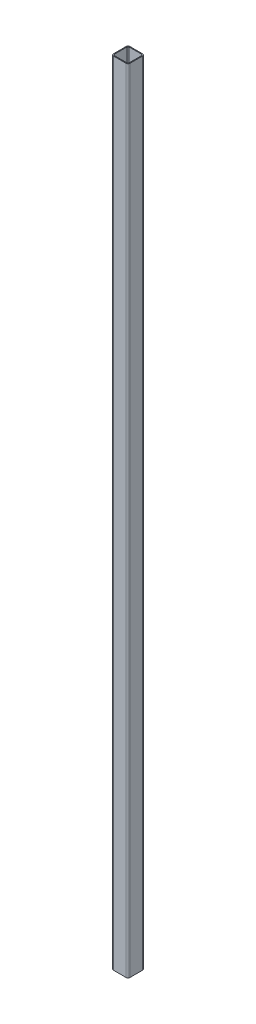
ISO-10303-21;
HEADER;
FILE_DESCRIPTION(('STEP AP214'),'2;1');
FILE_NAME('part.step','',(''),(''),'','','');
FILE_SCHEMA(('AUTOMOTIVE_DESIGN { 1 0 10303 214 1 1 1 1 }'));
ENDSEC;
DATA;
#1=APPLICATION_CONTEXT('core data for automotive mechanical design processes');
#2=APPLICATION_PROTOCOL_DEFINITION('international standard','automotive_design',2000,#1);
#3=PRODUCT_CONTEXT('',#1,'mechanical');
#4=PRODUCT('Part','Part','',(#3));
#5=PRODUCT_RELATED_PRODUCT_CATEGORY('part','',(#4));
#6=PRODUCT_DEFINITION_FORMATION('','',#4);
#7=PRODUCT_DEFINITION_CONTEXT('part definition',#1,'design');
#8=PRODUCT_DEFINITION('design','',#6,#7);
#9=PRODUCT_DEFINITION_SHAPE('','',#8);
#10=(LENGTH_UNIT() NAMED_UNIT(*) SI_UNIT(.MILLI.,.METRE.));
#11=(NAMED_UNIT(*) PLANE_ANGLE_UNIT() SI_UNIT($,.RADIAN.));
#12=(NAMED_UNIT(*) SI_UNIT($,.STERADIAN.) SOLID_ANGLE_UNIT());
#13=UNCERTAINTY_MEASURE_WITH_UNIT(LENGTH_MEASURE(1.E-05),#10,'distance_accuracy_value','');
#14=(GEOMETRIC_REPRESENTATION_CONTEXT(3) GLOBAL_UNCERTAINTY_ASSIGNED_CONTEXT((#13)) GLOBAL_UNIT_ASSIGNED_CONTEXT((#10,
#11,#12)) REPRESENTATION_CONTEXT('',''));
#15=CARTESIAN_POINT('',(0.,0.,0.));
#16=DIRECTION('',(0.,0.,1.));
#17=DIRECTION('',(1.,0.,0.));
#18=AXIS2_PLACEMENT_3D('',#15,#16,#17);
#19=CARTESIAN_POINT('',(-15.5000000000052,3.99680288865056E-12,-931.5));
#20=DIRECTION('',(0.,0.,1.));
#21=DIRECTION('',(0.,-1.,0.));
#22=AXIS2_PLACEMENT_3D('',#19,#20,#21);
#23=PLANE('',#22);
#24=DIRECTION('',(0.,1.,0.));
#25=VECTOR('',#24,1.);
#26=CARTESIAN_POINT('',(-15.5000000000052,3.99680288865056E-12,-931.5));
#27=LINE('',#26,#25);
#28=CARTESIAN_POINT('',(-15.4999999999936,20.000000000004,-931.500000000001));
#29=VERTEX_POINT('',#28);
#30=CARTESIAN_POINT('',(-15.5000000000052,1940.,-931.5));
#31=VERTEX_POINT('',#30);
#32=EDGE_CURVE('E198',#29,#31,#27,.T.);
#33=ORIENTED_EDGE('',*,*,#32,.T.);
#34=DIRECTION('',(-1.,0.,0.));
#35=VECTOR('',#34,1.);
#36=CARTESIAN_POINT('',(-15.5000000000052,1940.,-931.5));
#37=LINE('',#36,#35);
#38=CARTESIAN_POINT('',(15.4999999999945,1940.,-931.5));
#39=VERTEX_POINT('',#38);
#40=EDGE_CURVE('E290',#39,#31,#37,.T.);
#41=ORIENTED_EDGE('',*,*,#40,.F.);
#42=DIRECTION('',(0.,1.,0.));
#43=VECTOR('',#42,1.);
#44=CARTESIAN_POINT('',(15.499999999995,1.33226762955019E-12,-931.5));
#45=LINE('',#44,#43);
#46=CARTESIAN_POINT('',(15.5000000000065,20.0000000000014,-931.500000000001));
#47=VERTEX_POINT('',#46);
#48=EDGE_CURVE('E195',#47,#39,#45,.T.);
#49=ORIENTED_EDGE('',*,*,#48,.F.);
#50=DIRECTION('',(1.,0.,0.));
#51=VECTOR('',#50,1.);
#52=CARTESIAN_POINT('',(-15.4999999999936,20.000000000004,-931.500000000001));
#53=LINE('',#52,#51);
#54=EDGE_CURVE('E313',#29,#47,#53,.T.);
#55=ORIENTED_EDGE('',*,*,#54,.F.);
#56=EDGE_LOOP('',(#33,#41,#49,#55));
#57=FACE_BOUND('',#56,.T.);
#58=ADVANCED_FACE('F43',(#57),#23,.F.);
#59=CARTESIAN_POINT('',(-15.5000000000038,20.,2.22044604925031E-13));
#60=DIRECTION('',(0.,-1.,0.));
#61=DIRECTION('',(0.,0.,-1.));
#62=AXIS2_PLACEMENT_3D('',#59,#60,#61);
#63=PLANE('',#62);
#64=DIRECTION('',(-1.,0.,0.));
#65=VECTOR('',#64,1.);
#66=CARTESIAN_POINT('',(-15.0000000000037,20.000000000004,-893.5));
#67=LINE('',#66,#65);
#68=CARTESIAN_POINT('',(14.9999999999961,20.000000000004,-893.5));
#69=VERTEX_POINT('',#68);
#70=CARTESIAN_POINT('',(-15.0000000000037,20.000000000004,-893.5));
#71=VERTEX_POINT('',#70);
#72=EDGE_CURVE('E236',#69,#71,#67,.T.);
#73=ORIENTED_EDGE('',*,*,#72,.F.);
#74=CARTESIAN_POINT('',(14.9999999999961,20.000000000004,-896.500000000001));
#75=DIRECTION('',(0.,-1.,0.));
#76=DIRECTION('',(0.,0.,-1.));
#77=AXIS2_PLACEMENT_3D('',#74,#75,#76);
#78=CIRCLE('',#77,3.);
#79=CARTESIAN_POINT('',(17.9999999999962,20.,-896.5));
#80=VERTEX_POINT('',#79);
#81=EDGE_CURVE('E232',#80,#69,#78,.T.);
#82=ORIENTED_EDGE('',*,*,#81,.F.);
#83=DIRECTION('',(0.,0.,1.));
#84=VECTOR('',#83,1.);
#85=CARTESIAN_POINT('',(17.9999999999962,20.,-896.500000000001));
#86=LINE('',#85,#84);
#87=CARTESIAN_POINT('',(18.0000000000065,20.,-926.500000000001));
#88=VERTEX_POINT('',#87);
#89=EDGE_CURVE('E228',#88,#80,#86,.T.);
#90=ORIENTED_EDGE('',*,*,#89,.F.);
#91=CARTESIAN_POINT('',(15.0000000000068,20.000000000004,-926.500000000001));
#92=DIRECTION('',(0.,-1.,0.));
#93=DIRECTION('',(0.,0.,-1.));
#94=AXIS2_PLACEMENT_3D('',#91,#92,#93);
#95=CIRCLE('',#94,3.);
#96=CARTESIAN_POINT('',(15.0000000000068,20.,-929.500000000001));
#97=VERTEX_POINT('',#96);
#98=EDGE_CURVE('E223',#97,#88,#95,.T.);
#99=ORIENTED_EDGE('',*,*,#98,.F.);
#100=DIRECTION('',(1.,0.,0.));
#101=VECTOR('',#100,1.);
#102=CARTESIAN_POINT('',(-14.9999999999935,20.,-929.500000000001));
#103=LINE('',#102,#101);
#104=CARTESIAN_POINT('',(-14.9999999999935,20.,-929.500000000001));
#105=VERTEX_POINT('',#104);
#106=EDGE_CURVE('E218',#105,#97,#103,.T.);
#107=ORIENTED_EDGE('',*,*,#106,.F.);
#108=CARTESIAN_POINT('',(-14.9999999999935,20.0000000000001,-926.500000000001));
#109=DIRECTION('',(0.,-1.,0.));
#110=DIRECTION('',(0.,0.,-1.));
#111=AXIS2_PLACEMENT_3D('',#108,#109,#110);
#112=CIRCLE('',#111,3.);
#113=CARTESIAN_POINT('',(-17.9999999999936,20.000000000004,-926.500000000001));
#114=VERTEX_POINT('',#113);
#115=EDGE_CURVE('E213',#114,#105,#112,.T.);
#116=ORIENTED_EDGE('',*,*,#115,.F.);
#117=DIRECTION('',(0.,0.,-1.));
#118=VECTOR('',#117,1.);
#119=CARTESIAN_POINT('',(-18.0000000000038,20.000000000004,-896.500000000001));
#120=LINE('',#119,#118);
#121=CARTESIAN_POINT('',(-18.0000000000038,20.000000000004,-896.500000000001));
#122=VERTEX_POINT('',#121);
#123=EDGE_CURVE('E178',#122,#114,#120,.T.);
#124=ORIENTED_EDGE('',*,*,#123,.F.);
#125=CARTESIAN_POINT('',(-15.0000000000037,20.0000000000001,-896.500000000001));
#126=DIRECTION('',(0.,-1.,0.));
#127=DIRECTION('',(0.,0.,-1.));
#128=AXIS2_PLACEMENT_3D('',#125,#126,#127);
#129=CIRCLE('',#128,3.);
#130=EDGE_CURVE('E256',#71,#122,#129,.T.);
#131=ORIENTED_EDGE('',*,*,#130,.F.);
#132=EDGE_LOOP('',(#73,#82,#90,#99,#107,#116,#124,#131));
#133=FACE_BOUND('',#132,.T.);
#134=CARTESIAN_POINT('',(-15.4999999999932,20.,-927.));
#135=DIRECTION('',(0.,-1.,0.));
#136=DIRECTION('',(0.,0.,-1.));
#137=AXIS2_PLACEMENT_3D('',#134,#135,#136);
#138=CIRCLE('',#137,4.5);
#139=CARTESIAN_POINT('',(-19.9999999999934,20.0000000000039,-926.999999999998));
#140=VERTEX_POINT('',#139);
#141=EDGE_CURVE('E295',#140,#29,#138,.T.);
#142=ORIENTED_EDGE('',*,*,#141,.T.);
#143=ORIENTED_EDGE('',*,*,#54,.T.);
#144=CARTESIAN_POINT('',(15.5000000000065,20.,-927.));
#145=DIRECTION('',(0.,-1.,0.));
#146=DIRECTION('',(0.,0.,-1.));
#147=AXIS2_PLACEMENT_3D('',#144,#145,#146);
#148=CIRCLE('',#147,4.5);
#149=CARTESIAN_POINT('',(20.0000000000067,20.000000000004,-927.000000000001));
#150=VERTEX_POINT('',#149);
#151=EDGE_CURVE('E162',#47,#150,#148,.T.);
#152=ORIENTED_EDGE('',*,*,#151,.T.);
#153=DIRECTION('',(0.,0.,-1.));
#154=VECTOR('',#153,1.);
#155=CARTESIAN_POINT('',(19.999999999996,20.,2.22044604925031E-13));
#156=LINE('',#155,#154);
#157=CARTESIAN_POINT('',(19.999999999996,20.0000000000039,-896.000000000001));
#158=VERTEX_POINT('',#157);
#159=EDGE_CURVE('E157',#158,#150,#156,.T.);
#160=ORIENTED_EDGE('',*,*,#159,.F.);
#161=CARTESIAN_POINT('',(15.4999999999963,20.,-896.000000000001));
#162=DIRECTION('',(0.,-1.,0.));
#163=DIRECTION('',(0.,0.,-1.));
#164=AXIS2_PLACEMENT_3D('',#161,#162,#163);
#165=CIRCLE('',#164,4.5);
#166=CARTESIAN_POINT('',(15.4999999999963,20.,-891.500000000001));
#167=VERTEX_POINT('',#166);
#168=EDGE_CURVE('E151',#158,#167,#165,.T.);
#169=ORIENTED_EDGE('',*,*,#168,.T.);
#170=DIRECTION('',(-1.,0.,0.));
#171=VECTOR('',#170,1.);
#172=CARTESIAN_POINT('',(-15.5000000000038,20.,-891.500000000001));
#173=LINE('',#172,#171);
#174=CARTESIAN_POINT('',(-15.5000000000038,20.,-891.500000000001));
#175=VERTEX_POINT('',#174);
#176=EDGE_CURVE('E154',#167,#175,#173,.T.);
#177=ORIENTED_EDGE('',*,*,#176,.T.);
#178=CARTESIAN_POINT('',(-15.5000000000038,20.0000000000027,-896.000000000001));
#179=DIRECTION('',(0.,-1.,0.));
#180=DIRECTION('',(0.,0.,-1.));
#181=AXIS2_PLACEMENT_3D('',#178,#179,#180);
#182=CIRCLE('',#181,4.5);
#183=CARTESIAN_POINT('',(-20.000000000004,20.,-895.999999999996));
#184=VERTEX_POINT('',#183);
#185=EDGE_CURVE('E54',#175,#184,#182,.T.);
#186=ORIENTED_EDGE('',*,*,#185,.T.);
#187=DIRECTION('',(0.,0.,-1.));
#188=VECTOR('',#187,1.);
#189=CARTESIAN_POINT('',(-20.0000000000036,20.0000000000027,0.));
#190=LINE('',#189,#188);
#191=EDGE_CURVE('E11',#184,#140,#190,.T.);
#192=ORIENTED_EDGE('',*,*,#191,.T.);
#193=EDGE_LOOP('',(#142,#143,#152,#160,#169,#177,#186,#192));
#194=FACE_BOUND('',#193,.T.);
#195=ADVANCED_FACE('F153',(#133,#194),#63,.T.);
#196=CARTESIAN_POINT('',(15.499999999995,0.,-927.));
#197=DIRECTION('',(0.,1.,0.));
#198=DIRECTION('',(0.,0.,1.));
#199=AXIS2_PLACEMENT_3D('',#196,#197,#198);
#200=CYLINDRICAL_SURFACE('',#199,4.5);
#201=ORIENTED_EDGE('',*,*,#151,.F.);
#202=ORIENTED_EDGE('',*,*,#48,.T.);
#203=CARTESIAN_POINT('',(15.4999999999945,1940.,-927.));
#204=DIRECTION('',(0.,1.,0.));
#205=DIRECTION('',(0.,0.,1.));
#206=AXIS2_PLACEMENT_3D('',#203,#204,#205);
#207=CIRCLE('',#206,4.5);
#208=CARTESIAN_POINT('',(19.9999999999947,1940.,-927.));
#209=VERTEX_POINT('',#208);
#210=EDGE_CURVE('E285',#209,#39,#207,.T.);
#211=ORIENTED_EDGE('',*,*,#210,.F.);
#212=DIRECTION('',(0.,1.,0.));
#213=VECTOR('',#212,1.);
#214=CARTESIAN_POINT('',(19.9999999999947,3.99680288865056E-12,-927.));
#215=LINE('',#214,#213);
#216=EDGE_CURVE('E192',#150,#209,#215,.T.);
#217=ORIENTED_EDGE('',*,*,#216,.F.);
#218=EDGE_LOOP('',(#201,#202,#211,#217));
#219=FACE_BOUND('',#218,.T.);
#220=ADVANCED_FACE('F282',(#219),#200,.T.);
#221=CARTESIAN_POINT('',(20.,3.99680288865056E-12,-896.));
#222=DIRECTION('',(-1.,0.,0.));
#223=DIRECTION('',(0.,0.,1.));
#224=AXIS2_PLACEMENT_3D('',#221,#222,#223);
#225=PLANE('',#224);
#226=ORIENTED_EDGE('',*,*,#159,.T.);
#227=ORIENTED_EDGE('',*,*,#216,.T.);
#228=DIRECTION('',(0.,0.,1.));
#229=VECTOR('',#228,1.);
#230=CARTESIAN_POINT('',(20.0000000000107,1940.,-3060.00000000001));
#231=LINE('',#230,#229);
#232=CARTESIAN_POINT('',(20.,1940.,-896.));
#233=VERTEX_POINT('',#232);
#234=EDGE_CURVE('E188',#209,#233,#231,.T.);
#235=ORIENTED_EDGE('',*,*,#234,.T.);
#236=DIRECTION('',(0.,1.,0.));
#237=VECTOR('',#236,1.);
#238=CARTESIAN_POINT('',(20.,3.99680288865056E-12,-896.));
#239=LINE('',#238,#237);
#240=EDGE_CURVE('E179',#158,#233,#239,.T.);
#241=ORIENTED_EDGE('',*,*,#240,.F.);
#242=EDGE_LOOP('',(#226,#227,#235,#241));
#243=FACE_BOUND('',#242,.T.);
#244=ADVANCED_FACE('F276',(#243),#225,.F.);
#245=CARTESIAN_POINT('',(15.4999999999998,0.,-896.));
#246=DIRECTION('',(0.,1.,0.));
#247=DIRECTION('',(0.,0.,1.));
#248=AXIS2_PLACEMENT_3D('',#245,#246,#247);
#249=CYLINDRICAL_SURFACE('',#248,4.5);
#250=ORIENTED_EDGE('',*,*,#168,.F.);
#251=ORIENTED_EDGE('',*,*,#240,.T.);
#252=CARTESIAN_POINT('',(15.4999999999998,1940.,-896.));
#253=DIRECTION('',(0.,1.,0.));
#254=DIRECTION('',(0.,0.,1.));
#255=AXIS2_PLACEMENT_3D('',#252,#253,#254);
#256=CIRCLE('',#255,4.5);
#257=CARTESIAN_POINT('',(15.4999999999998,1940.,-891.5));
#258=VERTEX_POINT('',#257);
#259=EDGE_CURVE('E176',#258,#233,#256,.T.);
#260=ORIENTED_EDGE('',*,*,#259,.F.);
#261=DIRECTION('',(0.,1.,0.));
#262=VECTOR('',#261,1.);
#263=CARTESIAN_POINT('',(15.4999999999998,0.,-891.5));
#264=LINE('',#263,#262);
#265=EDGE_CURVE('E168',#167,#258,#264,.T.);
#266=ORIENTED_EDGE('',*,*,#265,.F.);
#267=EDGE_LOOP('',(#250,#251,#260,#266));
#268=FACE_BOUND('',#267,.T.);
#269=ADVANCED_FACE('F174',(#268),#249,.T.);
#270=CARTESIAN_POINT('',(-15.4999999999998,2.66453525910038E-12,-896.));
#271=DIRECTION('',(0.,1.,0.));
#272=DIRECTION('',(0.,0.,1.));
#273=AXIS2_PLACEMENT_3D('',#270,#271,#272);
#274=CYLINDRICAL_SURFACE('',#273,4.5);
#275=ORIENTED_EDGE('',*,*,#185,.F.);
#276=DIRECTION('',(0.,1.,0.));
#277=VECTOR('',#276,1.);
#278=CARTESIAN_POINT('',(-15.4999999999998,0.,-891.5));
#279=LINE('',#278,#277);
#280=CARTESIAN_POINT('',(-15.5000000000003,1940.,-891.5));
#281=VERTEX_POINT('',#280);
#282=EDGE_CURVE('E170',#175,#281,#279,.T.);
#283=ORIENTED_EDGE('',*,*,#282,.T.);
#284=CARTESIAN_POINT('',(-15.5000000000003,1940.,-896.));
#285=DIRECTION('',(0.,1.,0.));
#286=DIRECTION('',(0.,0.,1.));
#287=AXIS2_PLACEMENT_3D('',#284,#285,#286);
#288=CIRCLE('',#287,4.5);
#289=CARTESIAN_POINT('',(-20.,1940.,-895.999999999996));
#290=VERTEX_POINT('',#289);
#291=EDGE_CURVE('E300',#290,#281,#288,.T.);
#292=ORIENTED_EDGE('',*,*,#291,.F.);
#293=DIRECTION('',(0.,1.,0.));
#294=VECTOR('',#293,1.);
#295=CARTESIAN_POINT('',(-20.,0.,-896.));
#296=LINE('',#295,#294);
#297=EDGE_CURVE('E204',#184,#290,#296,.T.);
#298=ORIENTED_EDGE('',*,*,#297,.F.);
#299=EDGE_LOOP('',(#275,#283,#292,#298));
#300=FACE_BOUND('',#299,.T.);
#301=ADVANCED_FACE('F328',(#300),#274,.T.);
#302=CARTESIAN_POINT('',(-20.,0.,-896.));
#303=DIRECTION('',(1.,0.,0.));
#304=DIRECTION('',(0.,0.,-1.));
#305=AXIS2_PLACEMENT_3D('',#302,#303,#304);
#306=PLANE('',#305);
#307=ORIENTED_EDGE('',*,*,#191,.F.);
#308=ORIENTED_EDGE('',*,*,#297,.T.);
#309=DIRECTION('',(0.,0.,1.));
#310=VECTOR('',#309,1.);
#311=CARTESIAN_POINT('',(-19.9999999999894,1940.,-3060.00000000001));
#312=LINE('',#311,#310);
#313=CARTESIAN_POINT('',(-20.0000000000053,1940.,-926.999999999997));
#314=VERTEX_POINT('',#313);
#315=EDGE_CURVE('E306',#314,#290,#312,.T.);
#316=ORIENTED_EDGE('',*,*,#315,.F.);
#317=DIRECTION('',(0.,1.,0.));
#318=VECTOR('',#317,1.);
#319=CARTESIAN_POINT('',(-20.0000000000053,3.99680288865056E-12,-927.));
#320=LINE('',#319,#318);
#321=EDGE_CURVE('E201',#140,#314,#320,.T.);
#322=ORIENTED_EDGE('',*,*,#321,.F.);
#323=EDGE_LOOP('',(#307,#308,#316,#322));
#324=FACE_BOUND('',#323,.T.);
#325=ADVANCED_FACE('F324',(#324),#306,.F.);
#326=CARTESIAN_POINT('',(-15.5000000000052,0.,-927.));
#327=DIRECTION('',(0.,1.,0.));
#328=DIRECTION('',(0.,0.,1.));
#329=AXIS2_PLACEMENT_3D('',#326,#327,#328);
#330=CYLINDRICAL_SURFACE('',#329,4.5);
#331=ORIENTED_EDGE('',*,*,#141,.F.);
#332=ORIENTED_EDGE('',*,*,#321,.T.);
#333=CARTESIAN_POINT('',(-15.5000000000052,1940.,-927.));
#334=DIRECTION('',(0.,1.,0.));
#335=DIRECTION('',(0.,0.,1.));
#336=AXIS2_PLACEMENT_3D('',#333,#334,#335);
#337=CIRCLE('',#336,4.5);
#338=EDGE_CURVE('E302',#31,#314,#337,.T.);
#339=ORIENTED_EDGE('',*,*,#338,.F.);
#340=ORIENTED_EDGE('',*,*,#32,.F.);
#341=EDGE_LOOP('',(#331,#332,#339,#340));
#342=FACE_BOUND('',#341,.T.);
#343=ADVANCED_FACE('F374',(#342),#330,.T.);
#344=CARTESIAN_POINT('',(-15.0000000000001,0.,-896.5));
#345=DIRECTION('',(0.,1.,0.));
#346=DIRECTION('',(0.,0.,1.));
#347=AXIS2_PLACEMENT_3D('',#344,#345,#346);
#348=CYLINDRICAL_SURFACE('',#347,3.);
#349=DIRECTION('',(0.,1.,0.));
#350=VECTOR('',#349,1.);
#351=CARTESIAN_POINT('',(-15.0000000000001,3.99680288865056E-12,-893.5));
#352=LINE('',#351,#350);
#353=CARTESIAN_POINT('',(-15.0000000000001,1940.,-893.5));
#354=VERTEX_POINT('',#353);
#355=EDGE_CURVE('E233',#71,#354,#352,.T.);
#356=ORIENTED_EDGE('',*,*,#355,.F.);
#357=ORIENTED_EDGE('',*,*,#130,.T.);
#358=DIRECTION('',(0.,1.,0.));
#359=VECTOR('',#358,1.);
#360=CARTESIAN_POINT('',(-18.0000000000002,3.99680288865056E-12,-896.5));
#361=LINE('',#360,#359);
#362=CARTESIAN_POINT('',(-18.0000000000002,1940.,-896.5));
#363=VERTEX_POINT('',#362);
#364=EDGE_CURVE('E47',#122,#363,#361,.T.);
#365=ORIENTED_EDGE('',*,*,#364,.T.);
#366=CARTESIAN_POINT('',(-15.0000000000001,1940.,-896.5));
#367=DIRECTION('',(0.,1.,0.));
#368=DIRECTION('',(0.,0.,1.));
#369=AXIS2_PLACEMENT_3D('',#366,#367,#368);
#370=CIRCLE('',#369,3.);
#371=EDGE_CURVE('E247',#363,#354,#370,.T.);
#372=ORIENTED_EDGE('',*,*,#371,.T.);
#373=EDGE_LOOP('',(#356,#357,#365,#372));
#374=FACE_BOUND('',#373,.T.);
#375=ADVANCED_FACE('F45',(#374),#348,.F.);
#376=CARTESIAN_POINT('',(-15.0000000000001,3.99680288865056E-12,-893.5));
#377=DIRECTION('',(0.,0.,-1.));
#378=DIRECTION('',(0.,1.,0.));
#379=AXIS2_PLACEMENT_3D('',#376,#377,#378);
#380=PLANE('',#379);
#381=DIRECTION('',(0.,1.,0.));
#382=VECTOR('',#381,1.);
#383=CARTESIAN_POINT('',(15.0000000000001,3.99680288865056E-12,-893.5));
#384=LINE('',#383,#382);
#385=CARTESIAN_POINT('',(14.9999999999997,1940.,-893.5));
#386=VERTEX_POINT('',#385);
#387=EDGE_CURVE('E229',#69,#386,#384,.T.);
#388=ORIENTED_EDGE('',*,*,#387,.F.);
#389=ORIENTED_EDGE('',*,*,#72,.T.);
#390=ORIENTED_EDGE('',*,*,#355,.T.);
#391=DIRECTION('',(1.,0.,0.));
#392=VECTOR('',#391,1.);
#393=CARTESIAN_POINT('',(-15.0000000000001,1940.,-893.5));
#394=LINE('',#393,#392);
#395=EDGE_CURVE('E235',#354,#386,#394,.T.);
#396=ORIENTED_EDGE('',*,*,#395,.T.);
#397=EDGE_LOOP('',(#388,#389,#390,#396));
#398=FACE_BOUND('',#397,.T.);
#399=ADVANCED_FACE('F365',(#398),#380,.T.);
#400=CARTESIAN_POINT('',(15.0000000000001,3.99680288865056E-12,-896.5));
#401=DIRECTION('',(0.,1.,0.));
#402=DIRECTION('',(0.,0.,1.));
#403=AXIS2_PLACEMENT_3D('',#400,#401,#402);
#404=CYLINDRICAL_SURFACE('',#403,3.);
#405=DIRECTION('',(0.,1.,0.));
#406=VECTOR('',#405,1.);
#407=CARTESIAN_POINT('',(17.9999999999998,0.,-896.5));
#408=LINE('',#407,#406);
#409=CARTESIAN_POINT('',(17.9999999999998,1940.,-896.499999999999));
#410=VERTEX_POINT('',#409);
#411=EDGE_CURVE('E224',#80,#410,#408,.T.);
#412=ORIENTED_EDGE('',*,*,#411,.F.);
#413=ORIENTED_EDGE('',*,*,#81,.T.);
#414=ORIENTED_EDGE('',*,*,#387,.T.);
#415=CARTESIAN_POINT('',(14.9999999999997,1940.,-896.5));
#416=DIRECTION('',(0.,1.,0.));
#417=DIRECTION('',(0.,0.,1.));
#418=AXIS2_PLACEMENT_3D('',#415,#416,#417);
#419=CIRCLE('',#418,3.);
#420=EDGE_CURVE('E231',#386,#410,#419,.T.);
#421=ORIENTED_EDGE('',*,*,#420,.T.);
#422=EDGE_LOOP('',(#412,#413,#414,#421));
#423=FACE_BOUND('',#422,.T.);
#424=ADVANCED_FACE('F358',(#423),#404,.F.);
#425=CARTESIAN_POINT('',(17.9999999999998,0.,-896.5));
#426=DIRECTION('',(-1.,0.,0.));
#427=DIRECTION('',(0.,0.,1.));
#428=AXIS2_PLACEMENT_3D('',#425,#426,#427);
#429=PLANE('',#428);
#430=DIRECTION('',(0.,1.,0.));
#431=VECTOR('',#430,1.);
#432=CARTESIAN_POINT('',(17.9999999999949,0.,-926.5));
#433=LINE('',#432,#431);
#434=CARTESIAN_POINT('',(17.9999999999949,1940.,-926.499999999999));
#435=VERTEX_POINT('',#434);
#436=EDGE_CURVE('E219',#88,#435,#433,.T.);
#437=ORIENTED_EDGE('',*,*,#436,.F.);
#438=ORIENTED_EDGE('',*,*,#89,.T.);
#439=ORIENTED_EDGE('',*,*,#411,.T.);
#440=DIRECTION('',(0.,0.,-1.));
#441=VECTOR('',#440,1.);
#442=CARTESIAN_POINT('',(17.9999999999998,1940.,-896.5));
#443=LINE('',#442,#441);
#444=EDGE_CURVE('E227',#410,#435,#443,.T.);
#445=ORIENTED_EDGE('',*,*,#444,.T.);
#446=EDGE_LOOP('',(#437,#438,#439,#445));
#447=FACE_BOUND('',#446,.T.);
#448=ADVANCED_FACE('F372',(#447),#429,.T.);
#449=CARTESIAN_POINT('',(14.9999999999948,3.88578058618805E-12,-926.5));
#450=DIRECTION('',(0.,1.,0.));
#451=DIRECTION('',(0.,0.,1.));
#452=AXIS2_PLACEMENT_3D('',#449,#450,#451);
#453=CYLINDRICAL_SURFACE('',#452,3.);
#454=DIRECTION('',(0.,1.,0.));
#455=VECTOR('',#454,1.);
#456=CARTESIAN_POINT('',(14.9999999999948,0.,-929.5));
#457=LINE('',#456,#455);
#458=CARTESIAN_POINT('',(14.9999999999948,1940.,-929.5));
#459=VERTEX_POINT('',#458);
#460=EDGE_CURVE('E214',#97,#459,#457,.T.);
#461=ORIENTED_EDGE('',*,*,#460,.F.);
#462=ORIENTED_EDGE('',*,*,#98,.T.);
#463=ORIENTED_EDGE('',*,*,#436,.T.);
#464=CARTESIAN_POINT('',(14.9999999999948,1940.,-926.5));
#465=DIRECTION('',(0.,1.,0.));
#466=DIRECTION('',(0.,0.,1.));
#467=AXIS2_PLACEMENT_3D('',#464,#465,#466);
#468=CIRCLE('',#467,3.);
#469=EDGE_CURVE('E222',#435,#459,#468,.T.);
#470=ORIENTED_EDGE('',*,*,#469,.T.);
#471=EDGE_LOOP('',(#461,#462,#463,#470));
#472=FACE_BOUND('',#471,.T.);
#473=ADVANCED_FACE('F406',(#472),#453,.F.);
#474=CARTESIAN_POINT('',(-15.000000000005,0.,-929.5));
#475=DIRECTION('',(0.,0.,1.));
#476=DIRECTION('',(0.,-1.,0.));
#477=AXIS2_PLACEMENT_3D('',#474,#475,#476);
#478=PLANE('',#477);
#479=DIRECTION('',(0.,1.,0.));
#480=VECTOR('',#479,1.);
#481=CARTESIAN_POINT('',(-15.000000000005,0.,-929.5));
#482=LINE('',#481,#480);
#483=CARTESIAN_POINT('',(-15.0000000000055,1940.,-929.5));
#484=VERTEX_POINT('',#483);
#485=EDGE_CURVE('E210',#105,#484,#482,.T.);
#486=ORIENTED_EDGE('',*,*,#485,.F.);
#487=ORIENTED_EDGE('',*,*,#106,.T.);
#488=ORIENTED_EDGE('',*,*,#460,.T.);
#489=DIRECTION('',(-1.,0.,0.));
#490=VECTOR('',#489,1.);
#491=CARTESIAN_POINT('',(-15.0000000000055,1940.,-929.5));
#492=LINE('',#491,#490);
#493=EDGE_CURVE('E217',#459,#484,#492,.T.);
#494=ORIENTED_EDGE('',*,*,#493,.T.);
#495=EDGE_LOOP('',(#486,#487,#488,#494));
#496=FACE_BOUND('',#495,.T.);
#497=ADVANCED_FACE('F402',(#496),#478,.T.);
#498=CARTESIAN_POINT('',(-15.000000000005,0.,-926.5));
#499=DIRECTION('',(0.,1.,0.));
#500=DIRECTION('',(0.,0.,1.));
#501=AXIS2_PLACEMENT_3D('',#498,#499,#500);
#502=CYLINDRICAL_SURFACE('',#501,3.);
#503=DIRECTION('',(0.,1.,0.));
#504=VECTOR('',#503,1.);
#505=CARTESIAN_POINT('',(-18.0000000000051,3.99680288865056E-12,-926.5));
#506=LINE('',#505,#504);
#507=CARTESIAN_POINT('',(-18.0000000000051,1940.,-926.5));
#508=VERTEX_POINT('',#507);
#509=EDGE_CURVE('E186',#114,#508,#506,.T.);
#510=ORIENTED_EDGE('',*,*,#509,.F.);
#511=ORIENTED_EDGE('',*,*,#115,.T.);
#512=ORIENTED_EDGE('',*,*,#485,.T.);
#513=CARTESIAN_POINT('',(-15.0000000000055,1940.,-926.5));
#514=DIRECTION('',(0.,1.,0.));
#515=DIRECTION('',(0.,0.,1.));
#516=AXIS2_PLACEMENT_3D('',#513,#514,#515);
#517=CIRCLE('',#516,3.);
#518=EDGE_CURVE('E209',#484,#508,#517,.T.);
#519=ORIENTED_EDGE('',*,*,#518,.T.);
#520=EDGE_LOOP('',(#510,#511,#512,#519));
#521=FACE_BOUND('',#520,.T.);
#522=ADVANCED_FACE('F398',(#521),#502,.F.);
#523=CARTESIAN_POINT('',(-18.0000000000002,3.99680288865056E-12,-896.5));
#524=DIRECTION('',(1.,0.,0.));
#525=DIRECTION('',(0.,0.,-1.));
#526=AXIS2_PLACEMENT_3D('',#523,#524,#525);
#527=PLANE('',#526);
#528=ORIENTED_EDGE('',*,*,#364,.F.);
#529=ORIENTED_EDGE('',*,*,#123,.T.);
#530=ORIENTED_EDGE('',*,*,#509,.T.);
#531=DIRECTION('',(0.,0.,1.));
#532=VECTOR('',#531,1.);
#533=CARTESIAN_POINT('',(-18.0000000000002,1940.,-896.5));
#534=LINE('',#533,#532);
#535=EDGE_CURVE('E307',#508,#363,#534,.T.);
#536=ORIENTED_EDGE('',*,*,#535,.T.);
#537=EDGE_LOOP('',(#528,#529,#530,#536));
#538=FACE_BOUND('',#537,.T.);
#539=ADVANCED_FACE('F395',(#538),#527,.T.);
#540=CARTESIAN_POINT('',(-15.4999999999896,1940.,-3060.00000000001));
#541=DIRECTION('',(0.,1.,0.));
#542=DIRECTION('',(0.,0.,1.));
#543=AXIS2_PLACEMENT_3D('',#540,#541,#542);
#544=PLANE('',#543);
#545=ORIENTED_EDGE('',*,*,#535,.F.);
#546=ORIENTED_EDGE('',*,*,#518,.F.);
#547=ORIENTED_EDGE('',*,*,#493,.F.);
#548=ORIENTED_EDGE('',*,*,#469,.F.);
#549=ORIENTED_EDGE('',*,*,#444,.F.);
#550=ORIENTED_EDGE('',*,*,#420,.F.);
#551=ORIENTED_EDGE('',*,*,#395,.F.);
#552=ORIENTED_EDGE('',*,*,#371,.F.);
#553=EDGE_LOOP('',(#545,#546,#547,#548,#549,#550,#551,#552));
#554=FACE_BOUND('',#553,.T.);
#555=ORIENTED_EDGE('',*,*,#338,.T.);
#556=ORIENTED_EDGE('',*,*,#315,.T.);
#557=ORIENTED_EDGE('',*,*,#291,.T.);
#558=DIRECTION('',(1.,0.,0.));
#559=VECTOR('',#558,1.);
#560=CARTESIAN_POINT('',(-15.5000000000003,1940.,-891.5));
#561=LINE('',#560,#559);
#562=EDGE_CURVE('E297',#281,#258,#561,.T.);
#563=ORIENTED_EDGE('',*,*,#562,.T.);
#564=ORIENTED_EDGE('',*,*,#259,.T.);
#565=ORIENTED_EDGE('',*,*,#234,.F.);
#566=ORIENTED_EDGE('',*,*,#210,.T.);
#567=ORIENTED_EDGE('',*,*,#40,.T.);
#568=EDGE_LOOP('',(#555,#556,#557,#563,#564,#565,#566,#567));
#569=FACE_BOUND('',#568,.T.);
#570=ADVANCED_FACE('F362',(#554,#569),#544,.T.);
#571=CARTESIAN_POINT('',(-15.4999999999998,0.,-891.5));
#572=DIRECTION('',(0.,0.,-1.));
#573=DIRECTION('',(0.,1.,0.));
#574=AXIS2_PLACEMENT_3D('',#571,#572,#573);
#575=PLANE('',#574);
#576=ORIENTED_EDGE('',*,*,#562,.F.);
#577=ORIENTED_EDGE('',*,*,#282,.F.);
#578=ORIENTED_EDGE('',*,*,#176,.F.);
#579=ORIENTED_EDGE('',*,*,#265,.T.);
#580=EDGE_LOOP('',(#576,#577,#578,#579));
#581=FACE_BOUND('',#580,.T.);
#582=ADVANCED_FACE('F167',(#581),#575,.F.);
#583=CLOSED_SHELL('',(#58,#195,#220,#244,#269,#301,#325,#343,#375,#399,#424,#448,#473,#497,#522,
#539,#570,#582));
#584=MANIFOLD_SOLID_BREP('B2',#583);
#585=ADVANCED_BREP_SHAPE_REPRESENTATION('',(#18,#584),#14);
#586=SHAPE_DEFINITION_REPRESENTATION(#9,#585);
ENDSEC;
END-ISO-10303-21;
